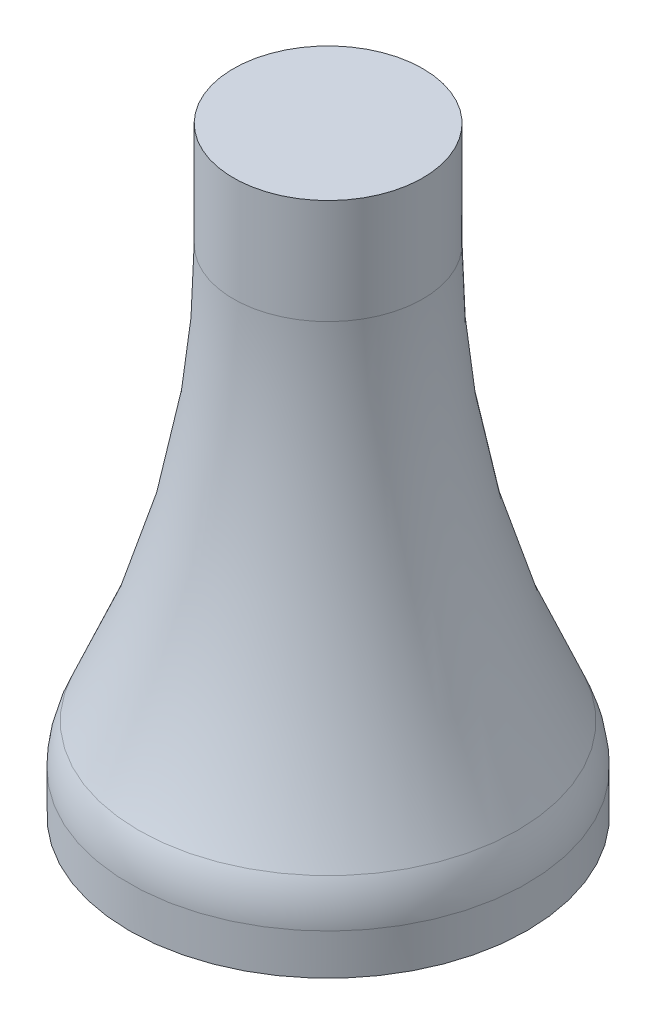
ISO-10303-21;
HEADER;
FILE_DESCRIPTION(('STEP AP214'),'2;1');
FILE_NAME('part.step','',(''),(''),'','','');
FILE_SCHEMA(('AUTOMOTIVE_DESIGN { 1 0 10303 214 1 1 1 1 }'));
ENDSEC;
DATA;
#1=APPLICATION_CONTEXT('core data for automotive mechanical design processes');
#2=APPLICATION_PROTOCOL_DEFINITION('international standard','automotive_design',2000,#1);
#3=PRODUCT_CONTEXT('',#1,'mechanical');
#4=PRODUCT('Part','Part','',(#3));
#5=PRODUCT_RELATED_PRODUCT_CATEGORY('part','',(#4));
#6=PRODUCT_DEFINITION_FORMATION('','',#4);
#7=PRODUCT_DEFINITION_CONTEXT('part definition',#1,'design');
#8=PRODUCT_DEFINITION('design','',#6,#7);
#9=PRODUCT_DEFINITION_SHAPE('','',#8);
#10=(LENGTH_UNIT() NAMED_UNIT(*) SI_UNIT(.MILLI.,.METRE.));
#11=(NAMED_UNIT(*) PLANE_ANGLE_UNIT() SI_UNIT($,.RADIAN.));
#12=(NAMED_UNIT(*) SI_UNIT($,.STERADIAN.) SOLID_ANGLE_UNIT());
#13=UNCERTAINTY_MEASURE_WITH_UNIT(LENGTH_MEASURE(1.E-05),#10,'distance_accuracy_value','');
#14=(GEOMETRIC_REPRESENTATION_CONTEXT(3) GLOBAL_UNCERTAINTY_ASSIGNED_CONTEXT((#13)) GLOBAL_UNIT_ASSIGNED_CONTEXT((#10,
#11,#12)) REPRESENTATION_CONTEXT('',''));
#15=CARTESIAN_POINT('',(0.,0.,0.));
#16=DIRECTION('',(0.,0.,1.));
#17=DIRECTION('',(1.,0.,0.));
#18=AXIS2_PLACEMENT_3D('',#15,#16,#17);
#19=CARTESIAN_POINT('',(0.,10.,0.));
#20=DIRECTION('',(0.,-1.,0.));
#21=DIRECTION('',(0.,0.,-1.));
#22=AXIS2_PLACEMENT_3D('',#19,#20,#21);
#23=CYLINDRICAL_SURFACE('',#22,31.5);
#24=CARTESIAN_POINT('',(0.,6.47224612264693,0.));
#25=DIRECTION('',(0.,-1.,0.));
#26=DIRECTION('',(0.,0.,-1.));
#27=AXIS2_PLACEMENT_3D('',#24,#25,#26);
#28=CIRCLE('',#27,31.5);
#29=CARTESIAN_POINT('',(0.,6.47224612264693,-31.5));
#30=VERTEX_POINT('',#29);
#31=EDGE_CURVE('E10',#30,#30,#28,.T.);
#32=ORIENTED_EDGE('',*,*,#31,.T.);
#33=EDGE_LOOP('',(#32));
#34=FACE_BOUND('',#33,.T.);
#35=CARTESIAN_POINT('',(0.,0.,0.));
#36=DIRECTION('',(0.,1.,0.));
#37=DIRECTION('',(0.,0.,1.));
#38=AXIS2_PLACEMENT_3D('',#35,#36,#37);
#39=CIRCLE('',#38,31.5);
#40=CARTESIAN_POINT('',(0.,0.,31.5));
#41=VERTEX_POINT('',#40);
#42=EDGE_CURVE('E48',#41,#41,#39,.T.);
#43=ORIENTED_EDGE('',*,*,#42,.T.);
#44=EDGE_LOOP('',(#43));
#45=FACE_BOUND('',#44,.T.);
#46=ADVANCED_FACE('F33',(#34,#45),#23,.T.);
#47=CARTESIAN_POINT('',(0.,0.,0.));
#48=DIRECTION('',(0.,1.,0.));
#49=DIRECTION('',(0.,0.,1.));
#50=AXIS2_PLACEMENT_3D('',#47,#48,#49);
#51=PLANE('',#50);
#52=ORIENTED_EDGE('',*,*,#42,.F.);
#53=EDGE_LOOP('',(#52));
#54=FACE_BOUND('',#53,.T.);
#55=ADVANCED_FACE('F61',(#54),#51,.F.);
#56=CARTESIAN_POINT('',(0.,95.,0.));
#57=DIRECTION('',(0.,1.,0.));
#58=DIRECTION('',(0.,0.,1.));
#59=AXIS2_PLACEMENT_3D('',#56,#57,#58);
#60=PLANE('',#59);
#61=CARTESIAN_POINT('',(0.,95.,0.));
#62=DIRECTION('',(0.,-1.,0.));
#63=DIRECTION('',(0.,0.,-1.));
#64=AXIS2_PLACEMENT_3D('',#61,#62,#63);
#65=CIRCLE('',#64,15.);
#66=CARTESIAN_POINT('',(0.,95.,-15.));
#67=VERTEX_POINT('',#66);
#68=EDGE_CURVE('E53',#67,#67,#65,.T.);
#69=ORIENTED_EDGE('',*,*,#68,.F.);
#70=EDGE_LOOP('',(#69));
#71=FACE_BOUND('',#70,.T.);
#72=ADVANCED_FACE('F59',(#71),#60,.T.);
#73=CARTESIAN_POINT('',(0.,0.,0.));
#74=DIRECTION('',(0.,-1.,0.));
#75=DIRECTION('',(0.,0.,-1.));
#76=AXIS2_PLACEMENT_3D('',#73,#74,#75);
#77=CYLINDRICAL_SURFACE('',#76,15.);
#78=CARTESIAN_POINT('',(0.,78.394078691068,0.));
#79=DIRECTION('',(0.,-1.,0.));
#80=DIRECTION('',(0.,0.,-1.));
#81=AXIS2_PLACEMENT_3D('',#78,#79,#80);
#82=CIRCLE('',#81,15.);
#83=CARTESIAN_POINT('',(0.,78.394078691068,-15.));
#84=VERTEX_POINT('',#83);
#85=EDGE_CURVE('E44',#84,#84,#82,.F.);
#86=ORIENTED_EDGE('',*,*,#85,.T.);
#87=EDGE_LOOP('',(#86));
#88=FACE_BOUND('',#87,.T.);
#89=ORIENTED_EDGE('',*,*,#68,.T.);
#90=EDGE_LOOP('',(#89));
#91=FACE_BOUND('',#90,.T.);
#92=ADVANCED_FACE('F57',(#88,#91),#77,.T.);
#93=CARTESIAN_POINT('',(0.,78.394078691068,0.));
#94=DIRECTION('',(0.,-1.,0.));
#95=DIRECTION('',(0.,0.,-1.));
#96=AXIS2_PLACEMENT_3D('',#93,#94,#95);
#97=TOROIDAL_SURFACE('',#96,165.,150.);
#98=CARTESIAN_POINT('',(0.,13.010594537958,0.));
#99=DIRECTION('',(0.,1.,0.));
#100=DIRECTION('',(0.,0.,1.));
#101=AXIS2_PLACEMENT_3D('',#98,#99,#100);
#102=CIRCLE('',#101,30.);
#103=CARTESIAN_POINT('',(0.,13.010594537958,30.));
#104=VERTEX_POINT('',#103);
#105=EDGE_CURVE('E40',#104,#104,#102,.T.);
#106=ORIENTED_EDGE('',*,*,#105,.T.);
#107=EDGE_LOOP('',(#106));
#108=FACE_BOUND('',#107,.T.);
#109=ORIENTED_EDGE('',*,*,#85,.F.);
#110=EDGE_LOOP('',(#109));
#111=FACE_BOUND('',#110,.T.);
#112=ADVANCED_FACE('F67',(#108,#111),#97,.F.);
#113=CARTESIAN_POINT('',(0.,6.47224612264693,0.));
#114=DIRECTION('',(0.,-1.,0.));
#115=DIRECTION('',(0.,0.,-1.));
#116=AXIS2_PLACEMENT_3D('',#113,#114,#115);
#117=TOROIDAL_SURFACE('',#116,16.5,15.);
#118=ORIENTED_EDGE('',*,*,#31,.F.);
#119=EDGE_LOOP('',(#118));
#120=FACE_BOUND('',#119,.T.);
#121=ORIENTED_EDGE('',*,*,#105,.F.);
#122=EDGE_LOOP('',(#121));
#123=FACE_BOUND('',#122,.T.);
#124=ADVANCED_FACE('F35',(#120,#123),#117,.T.);
#125=CLOSED_SHELL('',(#46,#55,#72,#92,#112,#124));
#126=MANIFOLD_SOLID_BREP('B2',#125);
#127=ADVANCED_BREP_SHAPE_REPRESENTATION('',(#18,#126),#14);
#128=SHAPE_DEFINITION_REPRESENTATION(#9,#127);
ENDSEC;
END-ISO-10303-21;
